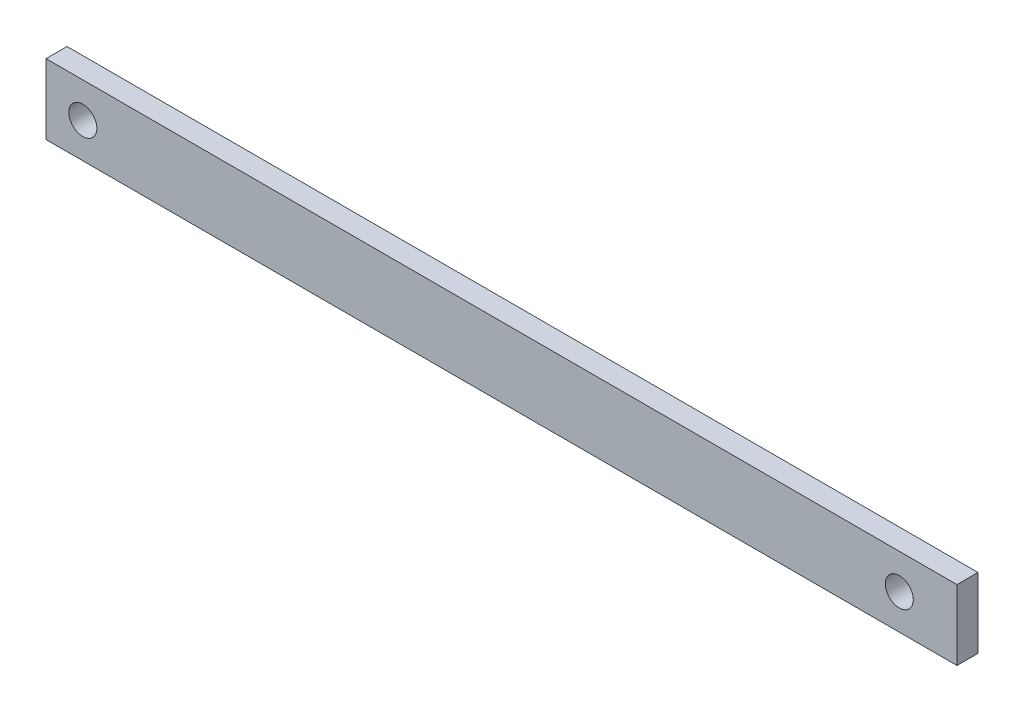
ISO-10303-21;
HEADER;
FILE_DESCRIPTION(('STEP AP214'),'2;1');
FILE_NAME('part.step','',(''),(''),'','','');
FILE_SCHEMA(('AUTOMOTIVE_DESIGN { 1 0 10303 214 1 1 1 1 }'));
ENDSEC;
DATA;
#1=APPLICATION_CONTEXT('core data for automotive mechanical design processes');
#2=APPLICATION_PROTOCOL_DEFINITION('international standard','automotive_design',2000,#1);
#3=PRODUCT_CONTEXT('',#1,'mechanical');
#4=PRODUCT('Part','Part','',(#3));
#5=PRODUCT_RELATED_PRODUCT_CATEGORY('part','',(#4));
#6=PRODUCT_DEFINITION_FORMATION('','',#4);
#7=PRODUCT_DEFINITION_CONTEXT('part definition',#1,'design');
#8=PRODUCT_DEFINITION('design','',#6,#7);
#9=PRODUCT_DEFINITION_SHAPE('','',#8);
#10=(LENGTH_UNIT() NAMED_UNIT(*) SI_UNIT(.MILLI.,.METRE.));
#11=(NAMED_UNIT(*) PLANE_ANGLE_UNIT() SI_UNIT($,.RADIAN.));
#12=(NAMED_UNIT(*) SI_UNIT($,.STERADIAN.) SOLID_ANGLE_UNIT());
#13=UNCERTAINTY_MEASURE_WITH_UNIT(LENGTH_MEASURE(1.E-05),#10,'distance_accuracy_value','');
#14=(GEOMETRIC_REPRESENTATION_CONTEXT(3) GLOBAL_UNCERTAINTY_ASSIGNED_CONTEXT((#13)) GLOBAL_UNIT_ASSIGNED_CONTEXT((#10,
#11,#12)) REPRESENTATION_CONTEXT('',''));
#15=CARTESIAN_POINT('',(0.,0.,0.));
#16=DIRECTION('',(0.,0.,1.));
#17=DIRECTION('',(1.,0.,0.));
#18=AXIS2_PLACEMENT_3D('',#15,#16,#17);
#19=CARTESIAN_POINT('',(65.,5.,3.));
#20=DIRECTION('',(-1.,0.,0.));
#21=DIRECTION('',(0.,0.,1.));
#22=AXIS2_PLACEMENT_3D('',#19,#20,#21);
#23=PLANE('',#22);
#24=DIRECTION('',(0.,1.,0.));
#25=VECTOR('',#24,1.);
#26=CARTESIAN_POINT('',(65.,5.,0.));
#27=LINE('',#26,#25);
#28=CARTESIAN_POINT('',(65.,-5.,0.));
#29=VERTEX_POINT('',#28);
#30=CARTESIAN_POINT('',(65.,5.,0.));
#31=VERTEX_POINT('',#30);
#32=EDGE_CURVE('E99',#29,#31,#27,.T.);
#33=ORIENTED_EDGE('',*,*,#32,.T.);
#34=DIRECTION('',(0.,0.,-1.));
#35=VECTOR('',#34,1.);
#36=CARTESIAN_POINT('',(65.,5.,3.));
#37=LINE('',#36,#35);
#38=CARTESIAN_POINT('',(65.,5.,3.));
#39=VERTEX_POINT('',#38);
#40=EDGE_CURVE('E11',#39,#31,#37,.T.);
#41=ORIENTED_EDGE('',*,*,#40,.F.);
#42=DIRECTION('',(0.,1.,0.));
#43=VECTOR('',#42,1.);
#44=CARTESIAN_POINT('',(65.,5.,3.));
#45=LINE('',#44,#43);
#46=CARTESIAN_POINT('',(65.,-5.,3.));
#47=VERTEX_POINT('',#46);
#48=EDGE_CURVE('E86',#47,#39,#45,.T.);
#49=ORIENTED_EDGE('',*,*,#48,.F.);
#50=DIRECTION('',(0.,0.,-1.));
#51=VECTOR('',#50,1.);
#52=CARTESIAN_POINT('',(65.,-5.,3.));
#53=LINE('',#52,#51);
#54=EDGE_CURVE('E95',#47,#29,#53,.T.);
#55=ORIENTED_EDGE('',*,*,#54,.T.);
#56=EDGE_LOOP('',(#33,#41,#49,#55));
#57=FACE_BOUND('',#56,.T.);
#58=ADVANCED_FACE('F33',(#57),#23,.F.);
#59=CARTESIAN_POINT('',(-65.,5.,3.));
#60=DIRECTION('',(0.,-1.,0.));
#61=DIRECTION('',(0.,0.,-1.));
#62=AXIS2_PLACEMENT_3D('',#59,#60,#61);
#63=PLANE('',#62);
#64=DIRECTION('',(-1.,0.,0.));
#65=VECTOR('',#64,1.);
#66=CARTESIAN_POINT('',(-65.,5.,0.));
#67=LINE('',#66,#65);
#68=CARTESIAN_POINT('',(-65.,5.,0.));
#69=VERTEX_POINT('',#68);
#70=EDGE_CURVE('E90',#31,#69,#67,.T.);
#71=ORIENTED_EDGE('',*,*,#70,.T.);
#72=DIRECTION('',(0.,0.,-1.));
#73=VECTOR('',#72,1.);
#74=CARTESIAN_POINT('',(-65.,5.,3.));
#75=LINE('',#74,#73);
#76=CARTESIAN_POINT('',(-65.,5.,3.));
#77=VERTEX_POINT('',#76);
#78=EDGE_CURVE('E42',#77,#69,#75,.T.);
#79=ORIENTED_EDGE('',*,*,#78,.F.);
#80=DIRECTION('',(-1.,0.,0.));
#81=VECTOR('',#80,1.);
#82=CARTESIAN_POINT('',(-65.,5.,3.));
#83=LINE('',#82,#81);
#84=EDGE_CURVE('E81',#39,#77,#83,.T.);
#85=ORIENTED_EDGE('',*,*,#84,.F.);
#86=ORIENTED_EDGE('',*,*,#40,.T.);
#87=EDGE_LOOP('',(#71,#79,#85,#86));
#88=FACE_BOUND('',#87,.T.);
#89=ADVANCED_FACE('F89',(#88),#63,.F.);
#90=CARTESIAN_POINT('',(-65.,5.,3.));
#91=DIRECTION('',(1.,0.,0.));
#92=DIRECTION('',(0.,0.,-1.));
#93=AXIS2_PLACEMENT_3D('',#90,#91,#92);
#94=PLANE('',#93);
#95=DIRECTION('',(0.,-1.,0.));
#96=VECTOR('',#95,1.);
#97=CARTESIAN_POINT('',(-65.,5.,0.));
#98=LINE('',#97,#96);
#99=CARTESIAN_POINT('',(-65.,-5.,0.));
#100=VERTEX_POINT('',#99);
#101=EDGE_CURVE('E68',#69,#100,#98,.T.);
#102=ORIENTED_EDGE('',*,*,#101,.T.);
#103=DIRECTION('',(0.,0.,-1.));
#104=VECTOR('',#103,1.);
#105=CARTESIAN_POINT('',(-65.,-5.,3.));
#106=LINE('',#105,#104);
#107=CARTESIAN_POINT('',(-65.,-5.,3.));
#108=VERTEX_POINT('',#107);
#109=EDGE_CURVE('E91',#108,#100,#106,.T.);
#110=ORIENTED_EDGE('',*,*,#109,.F.);
#111=DIRECTION('',(0.,-1.,0.));
#112=VECTOR('',#111,1.);
#113=CARTESIAN_POINT('',(-65.,5.,3.));
#114=LINE('',#113,#112);
#115=EDGE_CURVE('E84',#77,#108,#114,.T.);
#116=ORIENTED_EDGE('',*,*,#115,.F.);
#117=ORIENTED_EDGE('',*,*,#78,.T.);
#118=EDGE_LOOP('',(#102,#110,#116,#117));
#119=FACE_BOUND('',#118,.T.);
#120=ADVANCED_FACE('F93',(#119),#94,.F.);
#121=CARTESIAN_POINT('',(-65.,-5.,3.));
#122=DIRECTION('',(0.,1.,0.));
#123=DIRECTION('',(0.,0.,1.));
#124=AXIS2_PLACEMENT_3D('',#121,#122,#123);
#125=PLANE('',#124);
#126=DIRECTION('',(1.,0.,0.));
#127=VECTOR('',#126,1.);
#128=CARTESIAN_POINT('',(-65.,-5.,0.));
#129=LINE('',#128,#127);
#130=EDGE_CURVE('E74',#100,#29,#129,.T.);
#131=ORIENTED_EDGE('',*,*,#130,.T.);
#132=ORIENTED_EDGE('',*,*,#54,.F.);
#133=DIRECTION('',(1.,0.,0.));
#134=VECTOR('',#133,1.);
#135=CARTESIAN_POINT('',(-65.,-5.,3.));
#136=LINE('',#135,#134);
#137=EDGE_CURVE('E51',#108,#47,#136,.T.);
#138=ORIENTED_EDGE('',*,*,#137,.F.);
#139=ORIENTED_EDGE('',*,*,#109,.T.);
#140=EDGE_LOOP('',(#131,#132,#138,#139));
#141=FACE_BOUND('',#140,.T.);
#142=ADVANCED_FACE('F126',(#141),#125,.F.);
#143=CARTESIAN_POINT('',(0.,0.,3.));
#144=DIRECTION('',(0.,0.,1.));
#145=DIRECTION('',(1.,0.,0.));
#146=AXIS2_PLACEMENT_3D('',#143,#144,#145);
#147=PLANE('',#146);
#148=CARTESIAN_POINT('',(-59.7442835398709,0.,3.));
#149=DIRECTION('',(0.,0.,1.));
#150=DIRECTION('',(1.,0.,0.));
#151=AXIS2_PLACEMENT_3D('',#148,#149,#150);
#152=CIRCLE('',#151,2.);
#153=CARTESIAN_POINT('',(-57.7442835398709,0.,3.));
#154=VERTEX_POINT('',#153);
#155=EDGE_CURVE('E108',#154,#154,#152,.T.);
#156=ORIENTED_EDGE('',*,*,#155,.F.);
#157=EDGE_LOOP('',(#156));
#158=FACE_BOUND('',#157,.T.);
#159=CARTESIAN_POINT('',(56.7675773683476,0.,3.));
#160=DIRECTION('',(0.,0.,1.));
#161=DIRECTION('',(1.,0.,0.));
#162=AXIS2_PLACEMENT_3D('',#159,#160,#161);
#163=CIRCLE('',#162,2.);
#164=CARTESIAN_POINT('',(58.7675773683476,0.,3.));
#165=VERTEX_POINT('',#164);
#166=EDGE_CURVE('E113',#165,#165,#163,.T.);
#167=ORIENTED_EDGE('',*,*,#166,.F.);
#168=EDGE_LOOP('',(#167));
#169=FACE_BOUND('',#168,.T.);
#170=ORIENTED_EDGE('',*,*,#48,.T.);
#171=ORIENTED_EDGE('',*,*,#84,.T.);
#172=ORIENTED_EDGE('',*,*,#115,.T.);
#173=ORIENTED_EDGE('',*,*,#137,.T.);
#174=EDGE_LOOP('',(#170,#171,#172,#173));
#175=FACE_BOUND('',#174,.T.);
#176=ADVANCED_FACE('F82',(#158,#169,#175),#147,.T.);
#177=CARTESIAN_POINT('',(0.,0.,0.));
#178=DIRECTION('',(0.,0.,1.));
#179=DIRECTION('',(1.,0.,0.));
#180=AXIS2_PLACEMENT_3D('',#177,#178,#179);
#181=PLANE('',#180);
#182=CARTESIAN_POINT('',(-59.7442835398709,0.,0.));
#183=DIRECTION('',(0.,0.,1.));
#184=DIRECTION('',(1.,0.,0.));
#185=AXIS2_PLACEMENT_3D('',#182,#183,#184);
#186=CIRCLE('',#185,2.);
#187=CARTESIAN_POINT('',(-57.7442835398709,0.,0.));
#188=VERTEX_POINT('',#187);
#189=EDGE_CURVE('E36',#188,#188,#186,.T.);
#190=ORIENTED_EDGE('',*,*,#189,.T.);
#191=EDGE_LOOP('',(#190));
#192=FACE_BOUND('',#191,.T.);
#193=CARTESIAN_POINT('',(56.7675773683476,0.,0.));
#194=DIRECTION('',(0.,0.,1.));
#195=DIRECTION('',(1.,0.,0.));
#196=AXIS2_PLACEMENT_3D('',#193,#194,#195);
#197=CIRCLE('',#196,2.);
#198=CARTESIAN_POINT('',(58.7675773683476,0.,0.));
#199=VERTEX_POINT('',#198);
#200=EDGE_CURVE('E106',#199,#199,#197,.T.);
#201=ORIENTED_EDGE('',*,*,#200,.T.);
#202=EDGE_LOOP('',(#201));
#203=FACE_BOUND('',#202,.T.);
#204=ORIENTED_EDGE('',*,*,#32,.F.);
#205=ORIENTED_EDGE('',*,*,#130,.F.);
#206=ORIENTED_EDGE('',*,*,#101,.F.);
#207=ORIENTED_EDGE('',*,*,#70,.F.);
#208=EDGE_LOOP('',(#204,#205,#206,#207));
#209=FACE_BOUND('',#208,.T.);
#210=ADVANCED_FACE('F125',(#192,#203,#209),#181,.F.);
#211=CARTESIAN_POINT('',(56.7675773683476,0.,-7.));
#212=DIRECTION('',(0.,0.,1.));
#213=DIRECTION('',(1.,0.,0.));
#214=AXIS2_PLACEMENT_3D('',#211,#212,#213);
#215=CYLINDRICAL_SURFACE('',#214,2.);
#216=ORIENTED_EDGE('',*,*,#166,.T.);
#217=EDGE_LOOP('',(#216));
#218=FACE_BOUND('',#217,.T.);
#219=ORIENTED_EDGE('',*,*,#200,.F.);
#220=EDGE_LOOP('',(#219));
#221=FACE_BOUND('',#220,.T.);
#222=ADVANCED_FACE('F121',(#218,#221),#215,.F.);
#223=CARTESIAN_POINT('',(-59.7442835398709,0.,-7.));
#224=DIRECTION('',(0.,0.,1.));
#225=DIRECTION('',(1.,0.,0.));
#226=AXIS2_PLACEMENT_3D('',#223,#224,#225);
#227=CYLINDRICAL_SURFACE('',#226,2.);
#228=ORIENTED_EDGE('',*,*,#155,.T.);
#229=EDGE_LOOP('',(#228));
#230=FACE_BOUND('',#229,.T.);
#231=ORIENTED_EDGE('',*,*,#189,.F.);
#232=EDGE_LOOP('',(#231));
#233=FACE_BOUND('',#232,.T.);
#234=ADVANCED_FACE('F171',(#230,#233),#227,.F.);
#235=CLOSED_SHELL('',(#58,#89,#120,#142,#176,#210,#222,#234));
#236=MANIFOLD_SOLID_BREP('B2',#235);
#237=ADVANCED_BREP_SHAPE_REPRESENTATION('',(#18,#236),#14);
#238=SHAPE_DEFINITION_REPRESENTATION(#9,#237);
ENDSEC;
END-ISO-10303-21;
